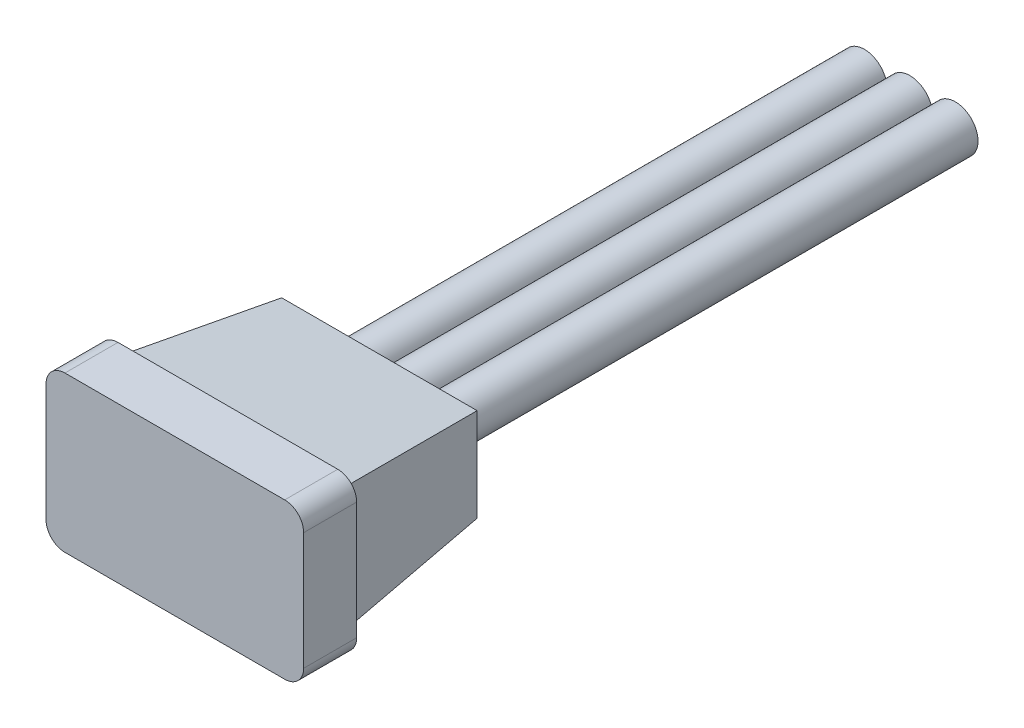
ISO-10303-21;
HEADER;
FILE_DESCRIPTION(('STEP AP214'),'2;1');
FILE_NAME('part.step','',(''),(''),'','','');
FILE_SCHEMA(('AUTOMOTIVE_DESIGN { 1 0 10303 214 1 1 1 1 }'));
ENDSEC;
DATA;
#1=APPLICATION_CONTEXT('core data for automotive mechanical design processes');
#2=APPLICATION_PROTOCOL_DEFINITION('international standard','automotive_design',2000,#1);
#3=PRODUCT_CONTEXT('',#1,'mechanical');
#4=PRODUCT('Part','Part','',(#3));
#5=PRODUCT_RELATED_PRODUCT_CATEGORY('part','',(#4));
#6=PRODUCT_DEFINITION_FORMATION('','',#4);
#7=PRODUCT_DEFINITION_CONTEXT('part definition',#1,'design');
#8=PRODUCT_DEFINITION('design','',#6,#7);
#9=PRODUCT_DEFINITION_SHAPE('','',#8);
#10=(LENGTH_UNIT() NAMED_UNIT(*) SI_UNIT(.MILLI.,.METRE.));
#11=(NAMED_UNIT(*) PLANE_ANGLE_UNIT() SI_UNIT($,.RADIAN.));
#12=(NAMED_UNIT(*) SI_UNIT($,.STERADIAN.) SOLID_ANGLE_UNIT());
#13=UNCERTAINTY_MEASURE_WITH_UNIT(LENGTH_MEASURE(1.E-05),#10,'distance_accuracy_value','');
#14=(GEOMETRIC_REPRESENTATION_CONTEXT(3) GLOBAL_UNCERTAINTY_ASSIGNED_CONTEXT((#13)) GLOBAL_UNIT_ASSIGNED_CONTEXT((#10,
#11,#12)) REPRESENTATION_CONTEXT('',''));
#15=CARTESIAN_POINT('',(0.,0.,0.));
#16=DIRECTION('',(0.,0.,1.));
#17=DIRECTION('',(1.,0.,0.));
#18=AXIS2_PLACEMENT_3D('',#15,#16,#17);
#19=CARTESIAN_POINT('',(1.2,0.,-21.0970562748477));
#20=DIRECTION('',(0.,0.,1.));
#21=DIRECTION('',(1.,0.,0.));
#22=AXIS2_PLACEMENT_3D('',#19,#20,#21);
#23=CYLINDRICAL_SURFACE('',#22,0.6);
#24=CARTESIAN_POINT('',(1.2,0.,-5.4));
#25=DIRECTION('',(0.,0.,-1.));
#26=DIRECTION('',(-1.,0.,0.));
#27=AXIS2_PLACEMENT_3D('',#24,#25,#26);
#28=CIRCLE('',#27,0.6);
#29=CARTESIAN_POINT('',(0.6,0.,-5.4));
#30=VERTEX_POINT('',#29);
#31=EDGE_CURVE('E46',#30,#30,#28,.T.);
#32=ORIENTED_EDGE('',*,*,#31,.T.);
#33=EDGE_LOOP('',(#32));
#34=FACE_BOUND('',#33,.T.);
#35=CARTESIAN_POINT('',(1.2,0.,-19.4));
#36=DIRECTION('',(0.,0.,-1.));
#37=DIRECTION('',(-1.,0.,0.));
#38=AXIS2_PLACEMENT_3D('',#35,#36,#37);
#39=CIRCLE('',#38,0.6);
#40=CARTESIAN_POINT('',(0.6,0.,-19.4));
#41=VERTEX_POINT('',#40);
#42=EDGE_CURVE('E11',#41,#41,#39,.T.);
#43=ORIENTED_EDGE('',*,*,#42,.F.);
#44=EDGE_LOOP('',(#43));
#45=FACE_BOUND('',#44,.T.);
#46=ADVANCED_FACE('F39',(#34,#45),#23,.T.);
#47=CARTESIAN_POINT('',(1.2,0.,-5.4));
#48=DIRECTION('',(0.,0.,-1.));
#49=DIRECTION('',(-1.,0.,0.));
#50=AXIS2_PLACEMENT_3D('',#47,#48,#49);
#51=PLANE('',#50);
#52=ORIENTED_EDGE('',*,*,#31,.F.);
#53=EDGE_LOOP('',(#52));
#54=FACE_BOUND('',#53,.T.);
#55=ADVANCED_FACE('F54',(#54),#51,.F.);
#56=CARTESIAN_POINT('',(0.,0.,-19.4));
#57=DIRECTION('',(0.,0.,-1.));
#58=DIRECTION('',(-1.,0.,0.));
#59=AXIS2_PLACEMENT_3D('',#56,#57,#58);
#60=PLANE('',#59);
#61=ORIENTED_EDGE('',*,*,#42,.T.);
#62=EDGE_LOOP('',(#61));
#63=FACE_BOUND('',#62,.T.);
#64=ADVANCED_FACE('F41',(#63),#60,.T.);
#65=CLOSED_SHELL('',(#46,#55,#64));
#66=MANIFOLD_SOLID_BREP('B2',#65);
#67=CARTESIAN_POINT('',(-1.2,0.,-21.0970562748477));
#68=DIRECTION('',(0.,0.,1.));
#69=DIRECTION('',(1.,0.,0.));
#70=AXIS2_PLACEMENT_3D('',#67,#68,#69);
#71=CYLINDRICAL_SURFACE('',#70,0.6);
#72=CARTESIAN_POINT('',(-1.2,0.,-5.4));
#73=DIRECTION('',(0.,0.,-1.));
#74=DIRECTION('',(-1.,0.,0.));
#75=AXIS2_PLACEMENT_3D('',#72,#73,#74);
#76=CIRCLE('',#75,0.6);
#77=CARTESIAN_POINT('',(-1.8,0.,-5.4));
#78=VERTEX_POINT('',#77);
#79=EDGE_CURVE('E94',#78,#78,#76,.T.);
#80=ORIENTED_EDGE('',*,*,#79,.T.);
#81=EDGE_LOOP('',(#80));
#82=FACE_BOUND('',#81,.T.);
#83=CARTESIAN_POINT('',(-1.2,0.,-19.4));
#84=DIRECTION('',(0.,0.,-1.));
#85=DIRECTION('',(-1.,0.,0.));
#86=AXIS2_PLACEMENT_3D('',#83,#84,#85);
#87=CIRCLE('',#86,0.6);
#88=CARTESIAN_POINT('',(-1.8,0.,-19.4));
#89=VERTEX_POINT('',#88);
#90=EDGE_CURVE('E38',#89,#89,#87,.T.);
#91=ORIENTED_EDGE('',*,*,#90,.F.);
#92=EDGE_LOOP('',(#91));
#93=FACE_BOUND('',#92,.T.);
#94=ADVANCED_FACE('F87',(#82,#93),#71,.T.);
#95=CARTESIAN_POINT('',(-1.2,0.,-5.4));
#96=DIRECTION('',(0.,0.,-1.));
#97=DIRECTION('',(-1.,0.,0.));
#98=AXIS2_PLACEMENT_3D('',#95,#96,#97);
#99=PLANE('',#98);
#100=ORIENTED_EDGE('',*,*,#79,.F.);
#101=EDGE_LOOP('',(#100));
#102=FACE_BOUND('',#101,.T.);
#103=ADVANCED_FACE('F102',(#102),#99,.F.);
#104=CARTESIAN_POINT('',(0.,0.,-19.4));
#105=DIRECTION('',(0.,0.,-1.));
#106=DIRECTION('',(-1.,0.,0.));
#107=AXIS2_PLACEMENT_3D('',#104,#105,#106);
#108=PLANE('',#107);
#109=ORIENTED_EDGE('',*,*,#90,.T.);
#110=EDGE_LOOP('',(#109));
#111=FACE_BOUND('',#110,.T.);
#112=ADVANCED_FACE('F89',(#111),#108,.T.);
#113=CLOSED_SHELL('',(#94,#103,#112));
#114=MANIFOLD_SOLID_BREP('B6',#113);
#115=CARTESIAN_POINT('',(0.,0.,-19.4));
#116=DIRECTION('',(0.,0.,1.));
#117=DIRECTION('',(1.,0.,0.));
#118=AXIS2_PLACEMENT_3D('',#115,#116,#117);
#119=CYLINDRICAL_SURFACE('',#118,0.6);
#120=CARTESIAN_POINT('',(0.,0.,-19.4));
#121=DIRECTION('',(0.,0.,-1.));
#122=DIRECTION('',(-1.,0.,0.));
#123=AXIS2_PLACEMENT_3D('',#120,#121,#122);
#124=CIRCLE('',#123,0.6);
#125=CARTESIAN_POINT('',(-0.6,0.,-19.4));
#126=VERTEX_POINT('',#125);
#127=EDGE_CURVE('E86',#126,#126,#124,.T.);
#128=ORIENTED_EDGE('',*,*,#127,.F.);
#129=EDGE_LOOP('',(#128));
#130=FACE_BOUND('',#129,.T.);
#131=CARTESIAN_POINT('',(0.,0.,-5.4));
#132=DIRECTION('',(0.,0.,-1.));
#133=DIRECTION('',(-1.,0.,0.));
#134=AXIS2_PLACEMENT_3D('',#131,#132,#133);
#135=CIRCLE('',#134,0.6);
#136=CARTESIAN_POINT('',(-0.6,0.,-5.4));
#137=VERTEX_POINT('',#136);
#138=EDGE_CURVE('E139',#137,#137,#135,.T.);
#139=ORIENTED_EDGE('',*,*,#138,.T.);
#140=EDGE_LOOP('',(#139));
#141=FACE_BOUND('',#140,.T.);
#142=ADVANCED_FACE('F136',(#130,#141),#119,.T.);
#143=CARTESIAN_POINT('',(0.,0.,-19.4));
#144=DIRECTION('',(0.,0.,-1.));
#145=DIRECTION('',(-1.,0.,0.));
#146=AXIS2_PLACEMENT_3D('',#143,#144,#145);
#147=PLANE('',#146);
#148=ORIENTED_EDGE('',*,*,#127,.T.);
#149=EDGE_LOOP('',(#148));
#150=FACE_BOUND('',#149,.T.);
#151=ADVANCED_FACE('F151',(#150),#147,.T.);
#152=CARTESIAN_POINT('',(0.,0.,-5.4));
#153=DIRECTION('',(0.,0.,-1.));
#154=DIRECTION('',(-1.,0.,0.));
#155=AXIS2_PLACEMENT_3D('',#152,#153,#154);
#156=PLANE('',#155);
#157=ORIENTED_EDGE('',*,*,#138,.F.);
#158=EDGE_LOOP('',(#157));
#159=FACE_BOUND('',#158,.T.);
#160=ADVANCED_FACE('F149',(#159),#156,.F.);
#161=CLOSED_SHELL('',(#142,#151,#160));
#162=MANIFOLD_SOLID_BREP('B33',#161);
#163=CARTESIAN_POINT('',(0.,0.,-1.4));
#164=DIRECTION('',(0.,0.,1.));
#165=DIRECTION('',(1.,0.,0.));
#166=AXIS2_PLACEMENT_3D('',#163,#164,#165);
#167=PLANE('',#166);
#168=DIRECTION('',(1.,0.,0.));
#169=VECTOR('',#168,1.);
#170=CARTESIAN_POINT('',(-3.4,-2.05,-1.4));
#171=LINE('',#170,#169);
#172=CARTESIAN_POINT('',(-2.9,-2.05,-1.4));
#173=VERTEX_POINT('',#172);
#174=CARTESIAN_POINT('',(2.9,-2.05,-1.4));
#175=VERTEX_POINT('',#174);
#176=EDGE_CURVE('E314',#173,#175,#171,.T.);
#177=ORIENTED_EDGE('',*,*,#176,.F.);
#178=CARTESIAN_POINT('',(-2.9,-1.55,-1.4));
#179=DIRECTION('',(0.,0.,1.));
#180=DIRECTION('',(1.,0.,0.));
#181=AXIS2_PLACEMENT_3D('',#178,#179,#180);
#182=CIRCLE('',#181,0.5);
#183=CARTESIAN_POINT('',(-3.4,-1.55,-1.4));
#184=VERTEX_POINT('',#183);
#185=EDGE_CURVE('E351',#173,#184,#182,.F.);
#186=ORIENTED_EDGE('',*,*,#185,.T.);
#187=DIRECTION('',(0.,-1.,0.));
#188=VECTOR('',#187,1.);
#189=CARTESIAN_POINT('',(-3.4,2.05,-1.4));
#190=LINE('',#189,#188);
#191=CARTESIAN_POINT('',(-3.4,1.55,-1.4));
#192=VERTEX_POINT('',#191);
#193=EDGE_CURVE('E311',#192,#184,#190,.T.);
#194=ORIENTED_EDGE('',*,*,#193,.F.);
#195=CARTESIAN_POINT('',(-2.9,1.55,-1.4));
#196=DIRECTION('',(0.,0.,1.));
#197=DIRECTION('',(1.,0.,0.));
#198=AXIS2_PLACEMENT_3D('',#195,#196,#197);
#199=CIRCLE('',#198,0.5);
#200=CARTESIAN_POINT('',(-2.9,2.05,-1.4));
#201=VERTEX_POINT('',#200);
#202=EDGE_CURVE('E191',#192,#201,#199,.F.);
#203=ORIENTED_EDGE('',*,*,#202,.T.);
#204=DIRECTION('',(-1.,0.,0.));
#205=VECTOR('',#204,1.);
#206=CARTESIAN_POINT('',(-3.4,2.05,-1.4));
#207=LINE('',#206,#205);
#208=CARTESIAN_POINT('',(2.9,2.05,-1.4));
#209=VERTEX_POINT('',#208);
#210=EDGE_CURVE('E308',#209,#201,#207,.T.);
#211=ORIENTED_EDGE('',*,*,#210,.F.);
#212=CARTESIAN_POINT('',(2.9,1.55,-1.4));
#213=DIRECTION('',(0.,0.,1.));
#214=DIRECTION('',(1.,0.,0.));
#215=AXIS2_PLACEMENT_3D('',#212,#213,#214);
#216=CIRCLE('',#215,0.5);
#217=CARTESIAN_POINT('',(3.4,1.55,-1.4));
#218=VERTEX_POINT('',#217);
#219=EDGE_CURVE('E346',#209,#218,#216,.F.);
#220=ORIENTED_EDGE('',*,*,#219,.T.);
#221=DIRECTION('',(0.,1.,0.));
#222=VECTOR('',#221,1.);
#223=CARTESIAN_POINT('',(3.4,2.05,-1.4));
#224=LINE('',#223,#222);
#225=CARTESIAN_POINT('',(3.4,-1.55,-1.4));
#226=VERTEX_POINT('',#225);
#227=EDGE_CURVE('E305',#226,#218,#224,.T.);
#228=ORIENTED_EDGE('',*,*,#227,.F.);
#229=CARTESIAN_POINT('',(2.9,-1.55,-1.4));
#230=DIRECTION('',(0.,0.,1.));
#231=DIRECTION('',(1.,0.,0.));
#232=AXIS2_PLACEMENT_3D('',#229,#230,#231);
#233=CIRCLE('',#232,0.5);
#234=EDGE_CURVE('E348',#226,#175,#233,.F.);
#235=ORIENTED_EDGE('',*,*,#234,.T.);
#236=EDGE_LOOP('',(#177,#186,#194,#203,#211,#220,#228,#235));
#237=FACE_BOUND('',#236,.T.);
#238=DIRECTION('',(0.,-1.,0.));
#239=VECTOR('',#238,1.);
#240=CARTESIAN_POINT('',(3.,1.65,-1.4));
#241=LINE('',#240,#239);
#242=CARTESIAN_POINT('',(3.,1.65,-1.4));
#243=VERTEX_POINT('',#242);
#244=CARTESIAN_POINT('',(3.,-1.65,-1.4));
#245=VERTEX_POINT('',#244);
#246=EDGE_CURVE('E265',#243,#245,#241,.T.);
#247=ORIENTED_EDGE('',*,*,#246,.F.);
#248=DIRECTION('',(1.,0.,0.));
#249=VECTOR('',#248,1.);
#250=CARTESIAN_POINT('',(-3.,1.65,-1.4));
#251=LINE('',#250,#249);
#252=CARTESIAN_POINT('',(-3.,1.65,-1.4));
#253=VERTEX_POINT('',#252);
#254=EDGE_CURVE('E267',#253,#243,#251,.T.);
#255=ORIENTED_EDGE('',*,*,#254,.F.);
#256=DIRECTION('',(0.,1.,0.));
#257=VECTOR('',#256,1.);
#258=CARTESIAN_POINT('',(-3.,1.65,-1.4));
#259=LINE('',#258,#257);
#260=CARTESIAN_POINT('',(-3.,-1.65,-1.4));
#261=VERTEX_POINT('',#260);
#262=EDGE_CURVE('E286',#261,#253,#259,.T.);
#263=ORIENTED_EDGE('',*,*,#262,.F.);
#264=DIRECTION('',(-1.,0.,0.));
#265=VECTOR('',#264,1.);
#266=CARTESIAN_POINT('',(-3.,-1.65,-1.4));
#267=LINE('',#266,#265);
#268=EDGE_CURVE('E270',#245,#261,#267,.T.);
#269=ORIENTED_EDGE('',*,*,#268,.F.);
#270=EDGE_LOOP('',(#247,#255,#263,#269));
#271=FACE_BOUND('',#270,.T.);
#272=ADVANCED_FACE('F176',(#237,#271),#167,.F.);
#273=CARTESIAN_POINT('',(3.4,2.05,-1.4));
#274=DIRECTION('',(1.,0.,0.));
#275=DIRECTION('',(0.,1.,0.));
#276=AXIS2_PLACEMENT_3D('',#273,#274,#275);
#277=PLANE('',#276);
#278=DIRECTION('',(0.,1.,0.));
#279=VECTOR('',#278,1.);
#280=CARTESIAN_POINT('',(3.4,2.05,0.));
#281=LINE('',#280,#279);
#282=CARTESIAN_POINT('',(3.4,-1.55,0.));
#283=VERTEX_POINT('',#282);
#284=CARTESIAN_POINT('',(3.4,1.55,0.));
#285=VERTEX_POINT('',#284);
#286=EDGE_CURVE('E318',#283,#285,#281,.T.);
#287=ORIENTED_EDGE('',*,*,#286,.F.);
#288=DIRECTION('',(0.,0.,1.));
#289=VECTOR('',#288,1.);
#290=CARTESIAN_POINT('',(3.4,-1.55,-1.4));
#291=LINE('',#290,#289);
#292=EDGE_CURVE('E134',#283,#226,#291,.F.);
#293=ORIENTED_EDGE('',*,*,#292,.T.);
#294=ORIENTED_EDGE('',*,*,#227,.T.);
#295=DIRECTION('',(0.,0.,1.));
#296=VECTOR('',#295,1.);
#297=CARTESIAN_POINT('',(3.4,1.55,-1.4));
#298=LINE('',#297,#296);
#299=EDGE_CURVE('E184',#218,#285,#298,.T.);
#300=ORIENTED_EDGE('',*,*,#299,.T.);
#301=EDGE_LOOP('',(#287,#293,#294,#300));
#302=FACE_BOUND('',#301,.T.);
#303=ADVANCED_FACE('F360',(#302),#277,.T.);
#304=CARTESIAN_POINT('',(-3.4,-2.05,-1.4));
#305=DIRECTION('',(0.,-1.,0.));
#306=DIRECTION('',(0.,0.,-1.));
#307=AXIS2_PLACEMENT_3D('',#304,#305,#306);
#308=PLANE('',#307);
#309=DIRECTION('',(1.,0.,0.));
#310=VECTOR('',#309,1.);
#311=CARTESIAN_POINT('',(-3.4,-2.05,0.));
#312=LINE('',#311,#310);
#313=CARTESIAN_POINT('',(-2.9,-2.05,0.));
#314=VERTEX_POINT('',#313);
#315=CARTESIAN_POINT('',(2.9,-2.05,0.));
#316=VERTEX_POINT('',#315);
#317=EDGE_CURVE('E309',#314,#316,#312,.T.);
#318=ORIENTED_EDGE('',*,*,#317,.F.);
#319=DIRECTION('',(0.,0.,1.));
#320=VECTOR('',#319,1.);
#321=CARTESIAN_POINT('',(-2.9,-2.05,-1.4));
#322=LINE('',#321,#320);
#323=EDGE_CURVE('E344',#314,#173,#322,.F.);
#324=ORIENTED_EDGE('',*,*,#323,.T.);
#325=ORIENTED_EDGE('',*,*,#176,.T.);
#326=DIRECTION('',(0.,0.,1.));
#327=VECTOR('',#326,1.);
#328=CARTESIAN_POINT('',(2.9,-2.05,-1.4));
#329=LINE('',#328,#327);
#330=EDGE_CURVE('E341',#175,#316,#329,.T.);
#331=ORIENTED_EDGE('',*,*,#330,.T.);
#332=EDGE_LOOP('',(#318,#324,#325,#331));
#333=FACE_BOUND('',#332,.T.);
#334=ADVANCED_FACE('F373',(#333),#308,.T.);
#335=CARTESIAN_POINT('',(-3.4,2.05,-1.4));
#336=DIRECTION('',(-1.,0.,0.));
#337=DIRECTION('',(0.,-1.,0.));
#338=AXIS2_PLACEMENT_3D('',#335,#336,#337);
#339=PLANE('',#338);
#340=ORIENTED_EDGE('',*,*,#193,.T.);
#341=DIRECTION('',(0.,0.,1.));
#342=VECTOR('',#341,1.);
#343=CARTESIAN_POINT('',(-3.4,-1.55,-1.4));
#344=LINE('',#343,#342);
#345=CARTESIAN_POINT('',(-3.4,-1.55,0.));
#346=VERTEX_POINT('',#345);
#347=EDGE_CURVE('E330',#184,#346,#344,.T.);
#348=ORIENTED_EDGE('',*,*,#347,.T.);
#349=DIRECTION('',(0.,-1.,0.));
#350=VECTOR('',#349,1.);
#351=CARTESIAN_POINT('',(-3.4,2.05,0.));
#352=LINE('',#351,#350);
#353=CARTESIAN_POINT('',(-3.4,1.55,0.));
#354=VERTEX_POINT('',#353);
#355=EDGE_CURVE('E324',#354,#346,#352,.T.);
#356=ORIENTED_EDGE('',*,*,#355,.F.);
#357=DIRECTION('',(0.,0.,1.));
#358=VECTOR('',#357,1.);
#359=CARTESIAN_POINT('',(-3.4,1.55,-1.4));
#360=LINE('',#359,#358);
#361=EDGE_CURVE('E317',#354,#192,#360,.F.);
#362=ORIENTED_EDGE('',*,*,#361,.T.);
#363=EDGE_LOOP('',(#340,#348,#356,#362));
#364=FACE_BOUND('',#363,.T.);
#365=ADVANCED_FACE('F382',(#364),#339,.T.);
#366=CARTESIAN_POINT('',(-3.4,2.05,-1.4));
#367=DIRECTION('',(0.,1.,0.));
#368=DIRECTION('',(0.,0.,1.));
#369=AXIS2_PLACEMENT_3D('',#366,#367,#368);
#370=PLANE('',#369);
#371=ORIENTED_EDGE('',*,*,#210,.T.);
#372=DIRECTION('',(0.,0.,1.));
#373=VECTOR('',#372,1.);
#374=CARTESIAN_POINT('',(-2.9,2.05,-1.4));
#375=LINE('',#374,#373);
#376=CARTESIAN_POINT('',(-2.9,2.05,0.));
#377=VERTEX_POINT('',#376);
#378=EDGE_CURVE('E354',#201,#377,#375,.T.);
#379=ORIENTED_EDGE('',*,*,#378,.T.);
#380=DIRECTION('',(-1.,0.,0.));
#381=VECTOR('',#380,1.);
#382=CARTESIAN_POINT('',(-3.4,2.05,0.));
#383=LINE('',#382,#381);
#384=CARTESIAN_POINT('',(2.9,2.05,0.));
#385=VERTEX_POINT('',#384);
#386=EDGE_CURVE('E321',#385,#377,#383,.T.);
#387=ORIENTED_EDGE('',*,*,#386,.F.);
#388=DIRECTION('',(0.,0.,1.));
#389=VECTOR('',#388,1.);
#390=CARTESIAN_POINT('',(2.9,2.05,-1.4));
#391=LINE('',#390,#389);
#392=EDGE_CURVE('E198',#385,#209,#391,.F.);
#393=ORIENTED_EDGE('',*,*,#392,.T.);
#394=EDGE_LOOP('',(#371,#379,#387,#393));
#395=FACE_BOUND('',#394,.T.);
#396=ADVANCED_FACE('F387',(#395),#370,.T.);
#397=CARTESIAN_POINT('',(0.,0.,0.));
#398=DIRECTION('',(0.,0.,1.));
#399=DIRECTION('',(1.,0.,0.));
#400=AXIS2_PLACEMENT_3D('',#397,#398,#399);
#401=PLANE('',#400);
#402=ORIENTED_EDGE('',*,*,#355,.T.);
#403=CARTESIAN_POINT('',(-2.9,-1.55,0.));
#404=DIRECTION('',(0.,0.,1.));
#405=DIRECTION('',(1.,0.,0.));
#406=AXIS2_PLACEMENT_3D('',#403,#404,#405);
#407=CIRCLE('',#406,0.5);
#408=EDGE_CURVE('E339',#346,#314,#407,.T.);
#409=ORIENTED_EDGE('',*,*,#408,.T.);
#410=ORIENTED_EDGE('',*,*,#317,.T.);
#411=CARTESIAN_POINT('',(2.9,-1.55,0.));
#412=DIRECTION('',(0.,0.,1.));
#413=DIRECTION('',(1.,0.,0.));
#414=AXIS2_PLACEMENT_3D('',#411,#412,#413);
#415=CIRCLE('',#414,0.5);
#416=EDGE_CURVE('E335',#316,#283,#415,.T.);
#417=ORIENTED_EDGE('',*,*,#416,.T.);
#418=ORIENTED_EDGE('',*,*,#286,.T.);
#419=CARTESIAN_POINT('',(2.9,1.55,0.));
#420=DIRECTION('',(0.,0.,1.));
#421=DIRECTION('',(1.,0.,0.));
#422=AXIS2_PLACEMENT_3D('',#419,#420,#421);
#423=CIRCLE('',#422,0.5);
#424=EDGE_CURVE('E333',#285,#385,#423,.T.);
#425=ORIENTED_EDGE('',*,*,#424,.T.);
#426=ORIENTED_EDGE('',*,*,#386,.T.);
#427=CARTESIAN_POINT('',(-2.9,1.55,0.));
#428=DIRECTION('',(0.,0.,1.));
#429=DIRECTION('',(1.,0.,0.));
#430=AXIS2_PLACEMENT_3D('',#427,#428,#429);
#431=CIRCLE('',#430,0.5);
#432=EDGE_CURVE('E337',#377,#354,#431,.T.);
#433=ORIENTED_EDGE('',*,*,#432,.T.);
#434=EDGE_LOOP('',(#402,#409,#410,#417,#418,#425,#426,#433));
#435=FACE_BOUND('',#434,.T.);
#436=ADVANCED_FACE('F366',(#435),#401,.T.);
#437=CARTESIAN_POINT('',(3.,1.65,-1.4));
#438=DIRECTION('',(0.994521895368273,0.,-0.104528463267654));
#439=DIRECTION('',(-0.104528463267654,0.,-0.994521895368273));
#440=AXIS2_PLACEMENT_3D('',#437,#438,#439);
#441=PLANE('',#440);
#442=ORIENTED_EDGE('',*,*,#246,.T.);
#443=DIRECTION('',(0.103962051184498,-0.103962051184498,0.989132844377854));
#444=VECTOR('',#443,1.);
#445=CARTESIAN_POINT('',(2.93515135148107,-1.58515135148107,-2.01699367637287));
#446=LINE('',#445,#444);
#447=CARTESIAN_POINT('',(2.57958305893729,-1.22958305893729,-5.4));
#448=VERTEX_POINT('',#447);
#449=EDGE_CURVE('E297',#448,#245,#446,.T.);
#450=ORIENTED_EDGE('',*,*,#449,.F.);
#451=DIRECTION('',(0.,1.,0.));
#452=VECTOR('',#451,1.);
#453=CARTESIAN_POINT('',(2.57958305893729,0.,-5.4));
#454=LINE('',#453,#452);
#455=CARTESIAN_POINT('',(2.57958305893729,1.22958305893729,-5.4));
#456=VERTEX_POINT('',#455);
#457=EDGE_CURVE('E285',#456,#448,#454,.F.);
#458=ORIENTED_EDGE('',*,*,#457,.F.);
#459=DIRECTION('',(0.103962051184498,0.103962051184498,0.989132844377854));
#460=VECTOR('',#459,1.);
#461=CARTESIAN_POINT('',(3.,1.65,-1.4));
#462=LINE('',#461,#460);
#463=EDGE_CURVE('E281',#456,#243,#462,.T.);
#464=ORIENTED_EDGE('',*,*,#463,.T.);
#465=EDGE_LOOP('',(#442,#450,#458,#464));
#466=FACE_BOUND('',#465,.T.);
#467=ADVANCED_FACE('F288',(#466),#441,.T.);
#468=CARTESIAN_POINT('',(-3.,-1.65,-1.4));
#469=DIRECTION('',(0.,-0.994521895368273,-0.104528463267654));
#470=DIRECTION('',(0.,0.104528463267654,-0.994521895368273));
#471=AXIS2_PLACEMENT_3D('',#468,#469,#470);
#472=PLANE('',#471);
#473=ORIENTED_EDGE('',*,*,#268,.T.);
#474=DIRECTION('',(-0.103962051184498,-0.103962051184498,0.989132844377854));
#475=VECTOR('',#474,1.);
#476=CARTESIAN_POINT('',(-2.96433324331459,-1.61433324331459,-1.73934652200508));
#477=LINE('',#476,#475);
#478=CARTESIAN_POINT('',(-2.57958305893729,-1.22958305893729,-5.4));
#479=VERTEX_POINT('',#478);
#480=EDGE_CURVE('E292',#479,#261,#477,.T.);
#481=ORIENTED_EDGE('',*,*,#480,.F.);
#482=DIRECTION('',(1.,0.,0.));
#483=VECTOR('',#482,1.);
#484=CARTESIAN_POINT('',(0.,-1.22958305893729,-5.4));
#485=LINE('',#484,#483);
#486=EDGE_CURVE('E302',#448,#479,#485,.F.);
#487=ORIENTED_EDGE('',*,*,#486,.F.);
#488=ORIENTED_EDGE('',*,*,#449,.T.);
#489=EDGE_LOOP('',(#473,#481,#487,#488));
#490=FACE_BOUND('',#489,.T.);
#491=ADVANCED_FACE('F400',(#490),#472,.T.);
#492=CARTESIAN_POINT('',(-3.,1.65,-1.4));
#493=DIRECTION('',(-0.994521895368273,0.,-0.104528463267654));
#494=DIRECTION('',(-0.104528463267654,0.,0.994521895368273));
#495=AXIS2_PLACEMENT_3D('',#492,#493,#494);
#496=PLANE('',#495);
#497=ORIENTED_EDGE('',*,*,#262,.T.);
#498=DIRECTION('',(-0.103962051184498,0.103962051184498,0.989132844377854));
#499=VECTOR('',#498,1.);
#500=CARTESIAN_POINT('',(-3.,1.65,-1.4));
#501=LINE('',#500,#499);
#502=CARTESIAN_POINT('',(-2.57958305893729,1.22958305893729,-5.4));
#503=VERTEX_POINT('',#502);
#504=EDGE_CURVE('E284',#503,#253,#501,.T.);
#505=ORIENTED_EDGE('',*,*,#504,.F.);
#506=DIRECTION('',(0.,-1.,0.));
#507=VECTOR('',#506,1.);
#508=CARTESIAN_POINT('',(-2.57958305893729,0.,-5.4));
#509=LINE('',#508,#507);
#510=EDGE_CURVE('E294',#479,#503,#509,.F.);
#511=ORIENTED_EDGE('',*,*,#510,.F.);
#512=ORIENTED_EDGE('',*,*,#480,.T.);
#513=EDGE_LOOP('',(#497,#505,#511,#512));
#514=FACE_BOUND('',#513,.T.);
#515=ADVANCED_FACE('F451',(#514),#496,.T.);
#516=CARTESIAN_POINT('',(-3.,1.65,-1.4));
#517=DIRECTION('',(0.,0.994521895368273,-0.104528463267654));
#518=DIRECTION('',(0.,0.104528463267654,0.994521895368273));
#519=AXIS2_PLACEMENT_3D('',#516,#517,#518);
#520=PLANE('',#519);
#521=ORIENTED_EDGE('',*,*,#254,.T.);
#522=ORIENTED_EDGE('',*,*,#463,.F.);
#523=DIRECTION('',(-1.,0.,0.));
#524=VECTOR('',#523,1.);
#525=CARTESIAN_POINT('',(0.,1.22958305893729,-5.4));
#526=LINE('',#525,#524);
#527=EDGE_CURVE('E290',#503,#456,#526,.F.);
#528=ORIENTED_EDGE('',*,*,#527,.F.);
#529=ORIENTED_EDGE('',*,*,#504,.T.);
#530=EDGE_LOOP('',(#521,#522,#528,#529));
#531=FACE_BOUND('',#530,.T.);
#532=ADVANCED_FACE('F279',(#531),#520,.T.);
#533=CARTESIAN_POINT('',(0.,0.,-5.4));
#534=DIRECTION('',(0.,0.,1.));
#535=DIRECTION('',(1.,0.,0.));
#536=AXIS2_PLACEMENT_3D('',#533,#534,#535);
#537=PLANE('',#536);
#538=ORIENTED_EDGE('',*,*,#457,.T.);
#539=ORIENTED_EDGE('',*,*,#486,.T.);
#540=ORIENTED_EDGE('',*,*,#510,.T.);
#541=ORIENTED_EDGE('',*,*,#527,.T.);
#542=EDGE_LOOP('',(#538,#539,#540,#541));
#543=FACE_BOUND('',#542,.T.);
#544=ADVANCED_FACE('F412',(#543),#537,.F.);
#545=CARTESIAN_POINT('',(-2.9,-1.55,-1.4));
#546=DIRECTION('',(0.,0.,1.));
#547=DIRECTION('',(1.,0.,0.));
#548=AXIS2_PLACEMENT_3D('',#545,#546,#547);
#549=CYLINDRICAL_SURFACE('',#548,0.5);
#550=ORIENTED_EDGE('',*,*,#185,.F.);
#551=ORIENTED_EDGE('',*,*,#323,.F.);
#552=ORIENTED_EDGE('',*,*,#408,.F.);
#553=ORIENTED_EDGE('',*,*,#347,.F.);
#554=EDGE_LOOP('',(#550,#551,#552,#553));
#555=FACE_BOUND('',#554,.T.);
#556=ADVANCED_FACE('F379',(#555),#549,.T.);
#557=CARTESIAN_POINT('',(-2.9,1.55,-1.4));
#558=DIRECTION('',(0.,0.,1.));
#559=DIRECTION('',(1.,0.,0.));
#560=AXIS2_PLACEMENT_3D('',#557,#558,#559);
#561=CYLINDRICAL_SURFACE('',#560,0.5);
#562=ORIENTED_EDGE('',*,*,#202,.F.);
#563=ORIENTED_EDGE('',*,*,#361,.F.);
#564=ORIENTED_EDGE('',*,*,#432,.F.);
#565=ORIENTED_EDGE('',*,*,#378,.F.);
#566=EDGE_LOOP('',(#562,#563,#564,#565));
#567=FACE_BOUND('',#566,.T.);
#568=ADVANCED_FACE('F386',(#567),#561,.T.);
#569=CARTESIAN_POINT('',(2.9,-1.55,-1.4));
#570=DIRECTION('',(0.,0.,1.));
#571=DIRECTION('',(1.,0.,0.));
#572=AXIS2_PLACEMENT_3D('',#569,#570,#571);
#573=CYLINDRICAL_SURFACE('',#572,0.5);
#574=ORIENTED_EDGE('',*,*,#234,.F.);
#575=ORIENTED_EDGE('',*,*,#292,.F.);
#576=ORIENTED_EDGE('',*,*,#416,.F.);
#577=ORIENTED_EDGE('',*,*,#330,.F.);
#578=EDGE_LOOP('',(#574,#575,#576,#577));
#579=FACE_BOUND('',#578,.T.);
#580=ADVANCED_FACE('F371',(#579),#573,.T.);
#581=CARTESIAN_POINT('',(2.9,1.55,-1.4));
#582=DIRECTION('',(0.,0.,1.));
#583=DIRECTION('',(1.,0.,0.));
#584=AXIS2_PLACEMENT_3D('',#581,#582,#583);
#585=CYLINDRICAL_SURFACE('',#584,0.5);
#586=ORIENTED_EDGE('',*,*,#219,.F.);
#587=ORIENTED_EDGE('',*,*,#392,.F.);
#588=ORIENTED_EDGE('',*,*,#424,.F.);
#589=ORIENTED_EDGE('',*,*,#299,.F.);
#590=EDGE_LOOP('',(#586,#587,#588,#589));
#591=FACE_BOUND('',#590,.T.);
#592=ADVANCED_FACE('F178',(#591),#585,.T.);
#593=CLOSED_SHELL('',(#272,#303,#334,#365,#396,#436,#467,#491,#515,#532,#544,#556,#568,#580,#592));
#594=MANIFOLD_SOLID_BREP('B81',#593);
#595=ADVANCED_BREP_SHAPE_REPRESENTATION('',(#18,#66,#114,#162,#594),#14);
#596=SHAPE_DEFINITION_REPRESENTATION(#9,#595);
ENDSEC;
END-ISO-10303-21;
